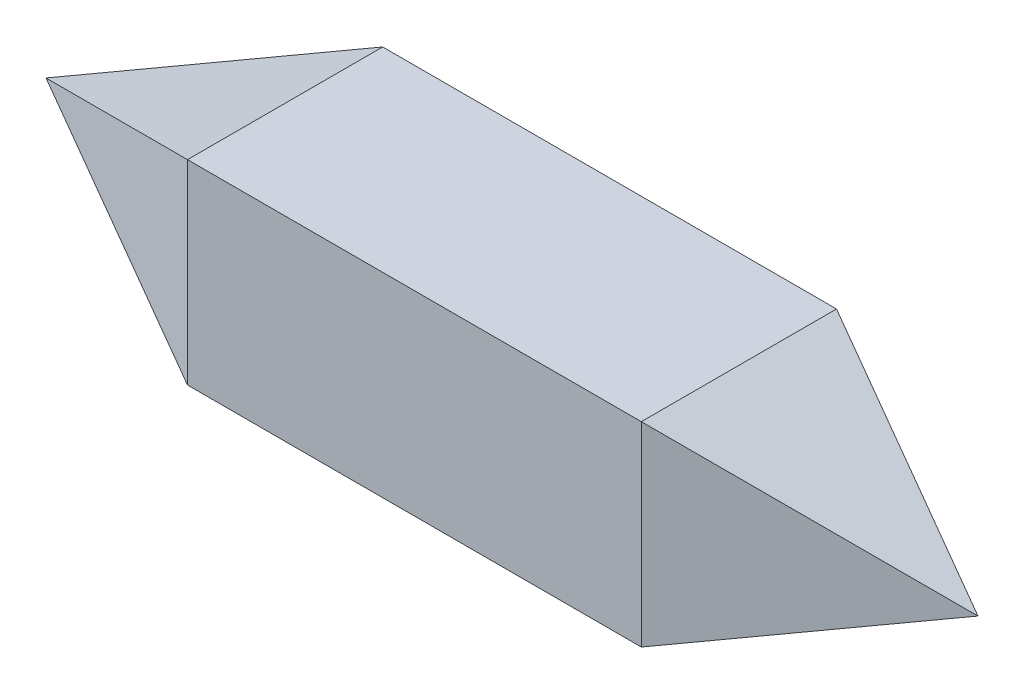
ISO-10303-21;
HEADER;
FILE_DESCRIPTION(('STEP AP214'),'2;1');
FILE_NAME('part.step','',(''),(''),'','','');
FILE_SCHEMA(('AUTOMOTIVE_DESIGN { 1 0 10303 214 1 1 1 1 }'));
ENDSEC;
DATA;
#1=APPLICATION_CONTEXT('core data for automotive mechanical design processes');
#2=APPLICATION_PROTOCOL_DEFINITION('international standard','automotive_design',2000,#1);
#3=PRODUCT_CONTEXT('',#1,'mechanical');
#4=PRODUCT('Part','Part','',(#3));
#5=PRODUCT_RELATED_PRODUCT_CATEGORY('part','',(#4));
#6=PRODUCT_DEFINITION_FORMATION('','',#4);
#7=PRODUCT_DEFINITION_CONTEXT('part definition',#1,'design');
#8=PRODUCT_DEFINITION('design','',#6,#7);
#9=PRODUCT_DEFINITION_SHAPE('','',#8);
#10=(LENGTH_UNIT() NAMED_UNIT(*) SI_UNIT(.MILLI.,.METRE.));
#11=(NAMED_UNIT(*) PLANE_ANGLE_UNIT() SI_UNIT($,.RADIAN.));
#12=(NAMED_UNIT(*) SI_UNIT($,.STERADIAN.) SOLID_ANGLE_UNIT());
#13=UNCERTAINTY_MEASURE_WITH_UNIT(LENGTH_MEASURE(1.E-05),#10,'distance_accuracy_value','');
#14=(GEOMETRIC_REPRESENTATION_CONTEXT(3) GLOBAL_UNCERTAINTY_ASSIGNED_CONTEXT((#13)) GLOBAL_UNIT_ASSIGNED_CONTEXT((#10,
#11,#12)) REPRESENTATION_CONTEXT('',''));
#15=CARTESIAN_POINT('',(0.,0.,0.));
#16=DIRECTION('',(0.,0.,1.));
#17=DIRECTION('',(1.,0.,0.));
#18=AXIS2_PLACEMENT_3D('',#15,#16,#17);
#19=CARTESIAN_POINT('',(0.,0.,430.1));
#20=DIRECTION('',(0.,1.,0.));
#21=DIRECTION('',(0.,0.,1.));
#22=AXIS2_PLACEMENT_3D('',#19,#20,#21);
#23=PLANE('',#22);
#24=DIRECTION('',(1.,0.,0.));
#25=VECTOR('',#24,1.);
#26=CARTESIAN_POINT('',(0.,0.,0.));
#27=LINE('',#26,#25);
#28=CARTESIAN_POINT('',(0.,0.,0.));
#29=VERTEX_POINT('',#28);
#30=CARTESIAN_POINT('',(1000.,0.,0.));
#31=VERTEX_POINT('',#30);
#32=EDGE_CURVE('E67',#29,#31,#27,.T.);
#33=ORIENTED_EDGE('',*,*,#32,.T.);
#34=DIRECTION('',(0.,0.,-1.));
#35=VECTOR('',#34,1.);
#36=CARTESIAN_POINT('',(1000.,0.,430.1));
#37=LINE('',#36,#35);
#38=CARTESIAN_POINT('',(1000.,0.,430.1));
#39=VERTEX_POINT('',#38);
#40=EDGE_CURVE('E47',#39,#31,#37,.T.);
#41=ORIENTED_EDGE('',*,*,#40,.F.);
#42=DIRECTION('',(1.,0.,0.));
#43=VECTOR('',#42,1.);
#44=CARTESIAN_POINT('',(0.,0.,430.1));
#45=LINE('',#44,#43);
#46=CARTESIAN_POINT('',(0.,0.,430.1));
#47=VERTEX_POINT('',#46);
#48=EDGE_CURVE('E85',#47,#39,#45,.T.);
#49=ORIENTED_EDGE('',*,*,#48,.F.);
#50=DIRECTION('',(0.,0.,-1.));
#51=VECTOR('',#50,1.);
#52=CARTESIAN_POINT('',(0.,0.,430.1));
#53=LINE('',#52,#51);
#54=EDGE_CURVE('E11',#47,#29,#53,.T.);
#55=ORIENTED_EDGE('',*,*,#54,.T.);
#56=EDGE_LOOP('',(#33,#41,#49,#55));
#57=FACE_BOUND('',#56,.T.);
#58=ADVANCED_FACE('F39',(#57),#23,.F.);
#59=CARTESIAN_POINT('',(0.,430.1,430.1));
#60=DIRECTION('',(0.,-1.,0.));
#61=DIRECTION('',(0.,0.,-1.));
#62=AXIS2_PLACEMENT_3D('',#59,#60,#61);
#63=PLANE('',#62);
#64=DIRECTION('',(-1.,0.,0.));
#65=VECTOR('',#64,1.);
#66=CARTESIAN_POINT('',(0.,430.1,0.));
#67=LINE('',#66,#65);
#68=CARTESIAN_POINT('',(1000.,430.1,0.));
#69=VERTEX_POINT('',#68);
#70=CARTESIAN_POINT('',(0.,430.1,0.));
#71=VERTEX_POINT('',#70);
#72=EDGE_CURVE('E127',#69,#71,#67,.T.);
#73=ORIENTED_EDGE('',*,*,#72,.T.);
#74=DIRECTION('',(0.,0.,-1.));
#75=VECTOR('',#74,1.);
#76=CARTESIAN_POINT('',(0.,430.1,430.1));
#77=LINE('',#76,#75);
#78=CARTESIAN_POINT('',(0.,430.1,430.1));
#79=VERTEX_POINT('',#78);
#80=EDGE_CURVE('E115',#79,#71,#77,.T.);
#81=ORIENTED_EDGE('',*,*,#80,.F.);
#82=DIRECTION('',(-1.,0.,0.));
#83=VECTOR('',#82,1.);
#84=CARTESIAN_POINT('',(0.,430.1,430.1));
#85=LINE('',#84,#83);
#86=CARTESIAN_POINT('',(1000.,430.1,430.1));
#87=VERTEX_POINT('',#86);
#88=EDGE_CURVE('E55',#87,#79,#85,.T.);
#89=ORIENTED_EDGE('',*,*,#88,.F.);
#90=DIRECTION('',(0.,0.,-1.));
#91=VECTOR('',#90,1.);
#92=CARTESIAN_POINT('',(1000.,430.1,430.1));
#93=LINE('',#92,#91);
#94=EDGE_CURVE('E101',#87,#69,#93,.T.);
#95=ORIENTED_EDGE('',*,*,#94,.T.);
#96=EDGE_LOOP('',(#73,#81,#89,#95));
#97=FACE_BOUND('',#96,.T.);
#98=ADVANCED_FACE('F134',(#97),#63,.F.);
#99=CARTESIAN_POINT('',(0.,0.,430.1));
#100=DIRECTION('',(0.,0.,-1.));
#101=DIRECTION('',(-1.,0.,0.));
#102=AXIS2_PLACEMENT_3D('',#99,#100,#101);
#103=PLANE('',#102);
#104=DIRECTION('',(0.,-1.,0.));
#105=VECTOR('',#104,1.);
#106=CARTESIAN_POINT('',(0.,0.,430.1));
#107=LINE('',#106,#105);
#108=EDGE_CURVE('E91',#79,#47,#107,.T.);
#109=ORIENTED_EDGE('',*,*,#108,.T.);
#110=ORIENTED_EDGE('',*,*,#48,.T.);
#111=DIRECTION('',(0.,1.,0.));
#112=VECTOR('',#111,1.);
#113=CARTESIAN_POINT('',(1000.,0.,430.1));
#114=LINE('',#113,#112);
#115=EDGE_CURVE('E89',#39,#87,#114,.T.);
#116=ORIENTED_EDGE('',*,*,#115,.T.);
#117=ORIENTED_EDGE('',*,*,#88,.T.);
#118=EDGE_LOOP('',(#109,#110,#116,#117));
#119=FACE_BOUND('',#118,.T.);
#120=ADVANCED_FACE('F87',(#119),#103,.F.);
#121=CARTESIAN_POINT('',(0.,0.,0.));
#122=DIRECTION('',(0.,0.,-1.));
#123=DIRECTION('',(-1.,0.,0.));
#124=AXIS2_PLACEMENT_3D('',#121,#122,#123);
#125=PLANE('',#124);
#126=DIRECTION('',(0.,-1.,0.));
#127=VECTOR('',#126,1.);
#128=CARTESIAN_POINT('',(0.,0.,0.));
#129=LINE('',#128,#127);
#130=EDGE_CURVE('E119',#71,#29,#129,.T.);
#131=ORIENTED_EDGE('',*,*,#130,.F.);
#132=ORIENTED_EDGE('',*,*,#72,.F.);
#133=DIRECTION('',(0.,1.,0.));
#134=VECTOR('',#133,1.);
#135=CARTESIAN_POINT('',(1000.,0.,0.));
#136=LINE('',#135,#134);
#137=EDGE_CURVE('E124',#31,#69,#136,.T.);
#138=ORIENTED_EDGE('',*,*,#137,.F.);
#139=ORIENTED_EDGE('',*,*,#32,.F.);
#140=EDGE_LOOP('',(#131,#132,#138,#139));
#141=FACE_BOUND('',#140,.T.);
#142=ADVANCED_FACE('F138',(#141),#125,.T.);
#143=CARTESIAN_POINT('',(0.,0.,0.));
#144=DIRECTION('',(-0.377937741687461,0.,-0.925831012338743));
#145=DIRECTION('',(-0.925831012338743,0.,0.377937741687461));
#146=AXIS2_PLACEMENT_3D('',#143,#144,#145);
#147=PLANE('',#146);
#148=ORIENTED_EDGE('',*,*,#130,.T.);
#149=DIRECTION('',(0.866043267620526,-0.353531511048989,-0.353531511048989));
#150=VECTOR('',#149,1.);
#151=CARTESIAN_POINT('',(0.,0.,0.));
#152=LINE('',#151,#150);
#153=CARTESIAN_POINT('',(-526.806236165994,215.05,215.05));
#154=VERTEX_POINT('',#153);
#155=EDGE_CURVE('E122',#154,#29,#152,.T.);
#156=ORIENTED_EDGE('',*,*,#155,.F.);
#157=DIRECTION('',(0.866043267620526,0.353531511048989,-0.353531511048989));
#158=VECTOR('',#157,1.);
#159=CARTESIAN_POINT('',(-131.685258923849,376.3441539461,53.7558460539003));
#160=LINE('',#159,#158);
#161=EDGE_CURVE('E142',#154,#71,#160,.T.);
#162=ORIENTED_EDGE('',*,*,#161,.T.);
#163=EDGE_LOOP('',(#148,#156,#162));
#164=FACE_BOUND('',#163,.T.);
#165=ADVANCED_FACE('F160',(#164),#147,.T.);
#166=CARTESIAN_POINT('',(0.,0.,0.));
#167=DIRECTION('',(-0.377937741687461,-0.925831012338743,0.));
#168=DIRECTION('',(0.925831012338743,-0.377937741687461,0.));
#169=AXIS2_PLACEMENT_3D('',#166,#167,#168);
#170=PLANE('',#169);
#171=ORIENTED_EDGE('',*,*,#54,.F.);
#172=DIRECTION('',(0.866043267620526,-0.353531511048989,0.353531511048989));
#173=VECTOR('',#172,1.);
#174=CARTESIAN_POINT('',(0.,0.,430.1));
#175=LINE('',#174,#173);
#176=EDGE_CURVE('E77',#154,#47,#175,.T.);
#177=ORIENTED_EDGE('',*,*,#176,.F.);
#178=ORIENTED_EDGE('',*,*,#155,.T.);
#179=EDGE_LOOP('',(#171,#177,#178));
#180=FACE_BOUND('',#179,.T.);
#181=ADVANCED_FACE('F157',(#180),#170,.T.);
#182=CARTESIAN_POINT('',(0.,0.,430.1));
#183=DIRECTION('',(-0.377937741687461,0.,0.925831012338743));
#184=DIRECTION('',(0.925831012338743,0.,0.377937741687461));
#185=AXIS2_PLACEMENT_3D('',#182,#183,#184);
#186=PLANE('',#185);
#187=ORIENTED_EDGE('',*,*,#108,.F.);
#188=DIRECTION('',(0.866043267620526,0.353531511048989,0.353531511048989));
#189=VECTOR('',#188,1.);
#190=CARTESIAN_POINT('',(-131.685258923849,376.3441539461,376.3441539461));
#191=LINE('',#190,#189);
#192=EDGE_CURVE('E151',#154,#79,#191,.T.);
#193=ORIENTED_EDGE('',*,*,#192,.F.);
#194=ORIENTED_EDGE('',*,*,#176,.T.);
#195=EDGE_LOOP('',(#187,#193,#194));
#196=FACE_BOUND('',#195,.T.);
#197=ADVANCED_FACE('F155',(#196),#186,.T.);
#198=CARTESIAN_POINT('',(0.,430.1,0.));
#199=DIRECTION('',(-0.377937741687461,0.925831012338743,0.));
#200=DIRECTION('',(-0.925831012338743,-0.377937741687461,0.));
#201=AXIS2_PLACEMENT_3D('',#198,#199,#200);
#202=PLANE('',#201);
#203=ORIENTED_EDGE('',*,*,#80,.T.);
#204=ORIENTED_EDGE('',*,*,#161,.F.);
#205=ORIENTED_EDGE('',*,*,#192,.T.);
#206=EDGE_LOOP('',(#203,#204,#205));
#207=FACE_BOUND('',#206,.T.);
#208=ADVANCED_FACE('F162',(#207),#202,.T.);
#209=CARTESIAN_POINT('',(1000.,0.,0.));
#210=DIRECTION('',(0.377937741687461,0.,-0.925831012338743));
#211=DIRECTION('',(-0.925831012338743,0.,-0.377937741687461));
#212=AXIS2_PLACEMENT_3D('',#209,#210,#211);
#213=PLANE('',#212);
#214=ORIENTED_EDGE('',*,*,#137,.T.);
#215=DIRECTION('',(-0.866043267620526,0.353531511048989,-0.353531511048989));
#216=VECTOR('',#215,1.);
#217=CARTESIAN_POINT('',(1000.,430.1,0.));
#218=LINE('',#217,#216);
#219=CARTESIAN_POINT('',(1526.80623616599,215.05,215.05));
#220=VERTEX_POINT('',#219);
#221=EDGE_CURVE('E139',#220,#69,#218,.T.);
#222=ORIENTED_EDGE('',*,*,#221,.F.);
#223=DIRECTION('',(-0.866043267620526,-0.353531511048989,-0.353531511048989));
#224=VECTOR('',#223,1.);
#225=CARTESIAN_POINT('',(1000.,0.,0.));
#226=LINE('',#225,#224);
#227=EDGE_CURVE('E105',#220,#31,#226,.T.);
#228=ORIENTED_EDGE('',*,*,#227,.T.);
#229=EDGE_LOOP('',(#214,#222,#228));
#230=FACE_BOUND('',#229,.T.);
#231=ADVANCED_FACE('F144',(#230),#213,.T.);
#232=CARTESIAN_POINT('',(1000.,430.1,0.));
#233=DIRECTION('',(0.377937741687461,0.925831012338743,0.));
#234=DIRECTION('',(-0.925831012338743,0.377937741687461,0.));
#235=AXIS2_PLACEMENT_3D('',#232,#233,#234);
#236=PLANE('',#235);
#237=ORIENTED_EDGE('',*,*,#94,.F.);
#238=DIRECTION('',(-0.866043267620526,0.353531511048989,0.353531511048989));
#239=VECTOR('',#238,1.);
#240=CARTESIAN_POINT('',(1131.68525892385,376.3441539461,376.3441539461));
#241=LINE('',#240,#239);
#242=EDGE_CURVE('E109',#220,#87,#241,.T.);
#243=ORIENTED_EDGE('',*,*,#242,.F.);
#244=ORIENTED_EDGE('',*,*,#221,.T.);
#245=EDGE_LOOP('',(#237,#243,#244));
#246=FACE_BOUND('',#245,.T.);
#247=ADVANCED_FACE('F140',(#246),#236,.T.);
#248=CARTESIAN_POINT('',(1000.,0.,430.1));
#249=DIRECTION('',(0.377937741687461,0.,0.925831012338743));
#250=DIRECTION('',(0.925831012338743,0.,-0.377937741687461));
#251=AXIS2_PLACEMENT_3D('',#248,#249,#250);
#252=PLANE('',#251);
#253=ORIENTED_EDGE('',*,*,#115,.F.);
#254=DIRECTION('',(-0.866043267620526,-0.353531511048989,0.353531511048988));
#255=VECTOR('',#254,1.);
#256=CARTESIAN_POINT('',(1131.68525892385,53.7558460539003,376.3441539461));
#257=LINE('',#256,#255);
#258=EDGE_CURVE('E103',#220,#39,#257,.T.);
#259=ORIENTED_EDGE('',*,*,#258,.F.);
#260=ORIENTED_EDGE('',*,*,#242,.T.);
#261=EDGE_LOOP('',(#253,#259,#260));
#262=FACE_BOUND('',#261,.T.);
#263=ADVANCED_FACE('F111',(#262),#252,.T.);
#264=CARTESIAN_POINT('',(1000.,0.,0.));
#265=DIRECTION('',(0.377937741687461,-0.925831012338743,0.));
#266=DIRECTION('',(0.925831012338743,0.377937741687461,0.));
#267=AXIS2_PLACEMENT_3D('',#264,#265,#266);
#268=PLANE('',#267);
#269=ORIENTED_EDGE('',*,*,#40,.T.);
#270=ORIENTED_EDGE('',*,*,#227,.F.);
#271=ORIENTED_EDGE('',*,*,#258,.T.);
#272=EDGE_LOOP('',(#269,#270,#271));
#273=FACE_BOUND('',#272,.T.);
#274=ADVANCED_FACE('F104',(#273),#268,.T.);
#275=CLOSED_SHELL('',(#58,#98,#120,#142,#165,#181,#197,#208,#231,#247,#263,#274));
#276=MANIFOLD_SOLID_BREP('B2',#275);
#277=ADVANCED_BREP_SHAPE_REPRESENTATION('',(#18,#276),#14);
#278=SHAPE_DEFINITION_REPRESENTATION(#9,#277);
ENDSEC;
END-ISO-10303-21;
